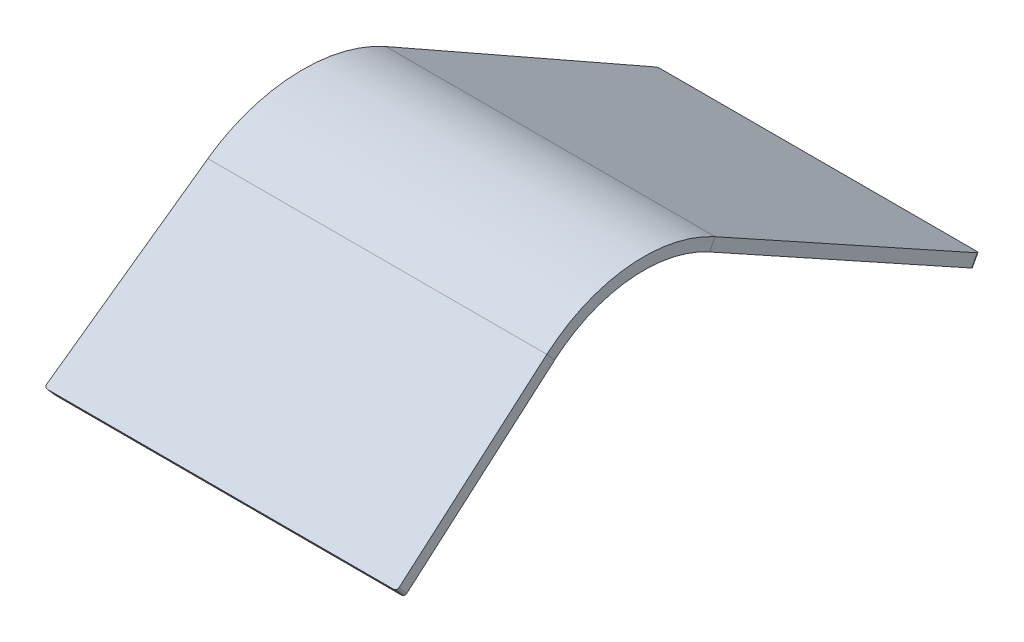
ISO-10303-21;
HEADER;
FILE_DESCRIPTION(('STEP AP214'),'2;1');
FILE_NAME('part.step','',(''),(''),'','','');
FILE_SCHEMA(('AUTOMOTIVE_DESIGN { 1 0 10303 214 1 1 1 1 }'));
ENDSEC;
DATA;
#1=APPLICATION_CONTEXT('core data for automotive mechanical design processes');
#2=APPLICATION_PROTOCOL_DEFINITION('international standard','automotive_design',2000,#1);
#3=PRODUCT_CONTEXT('',#1,'mechanical');
#4=PRODUCT('Part','Part','',(#3));
#5=PRODUCT_RELATED_PRODUCT_CATEGORY('part','',(#4));
#6=PRODUCT_DEFINITION_FORMATION('','',#4);
#7=PRODUCT_DEFINITION_CONTEXT('part definition',#1,'design');
#8=PRODUCT_DEFINITION('design','',#6,#7);
#9=PRODUCT_DEFINITION_SHAPE('','',#8);
#10=(LENGTH_UNIT() NAMED_UNIT(*) SI_UNIT(.MILLI.,.METRE.));
#11=(NAMED_UNIT(*) PLANE_ANGLE_UNIT() SI_UNIT($,.RADIAN.));
#12=(NAMED_UNIT(*) SI_UNIT($,.STERADIAN.) SOLID_ANGLE_UNIT());
#13=UNCERTAINTY_MEASURE_WITH_UNIT(LENGTH_MEASURE(1.E-05),#10,'distance_accuracy_value','');
#14=(GEOMETRIC_REPRESENTATION_CONTEXT(3) GLOBAL_UNCERTAINTY_ASSIGNED_CONTEXT((#13)) GLOBAL_UNIT_ASSIGNED_CONTEXT((#10,
#11,#12)) REPRESENTATION_CONTEXT('',''));
#15=CARTESIAN_POINT('',(0.,0.,0.));
#16=DIRECTION('',(0.,0.,1.));
#17=DIRECTION('',(1.,0.,0.));
#18=AXIS2_PLACEMENT_3D('',#15,#16,#17);
#19=CARTESIAN_POINT('',(148.,7.96839510967648,-2.12242299650277));
#20=DIRECTION('',(0.,0.87503404241775,-0.484061385167266));
#21=DIRECTION('',(0.,0.484061385167266,0.87503404241775));
#22=AXIS2_PLACEMENT_3D('',#19,#20,#21);
#23=CYLINDRICAL_SURFACE('',#22,2.);
#24=DIRECTION('',(0.,0.87503404241775,-0.484061385167266));
#25=VECTOR('',#24,1.);
#26=CARTESIAN_POINT('',(150.,7.96839510967642,-2.12242299650284));
#27=LINE('',#26,#25);
#28=CARTESIAN_POINT('',(150.,0.968122770334423,1.75006808483527));
#29=VERTEX_POINT('',#28);
#30=CARTESIAN_POINT('',(150.,7.96839510967642,-2.12242299650284));
#31=VERTEX_POINT('',#30);
#32=EDGE_CURVE('E11',#29,#31,#27,.T.);
#33=ORIENTED_EDGE('',*,*,#32,.F.);
#34=CARTESIAN_POINT('',(148.,0.968122770334473,1.75006808483535));
#35=DIRECTION('',(0.,-0.87503404241775,0.484061385167266));
#36=DIRECTION('',(0.,-0.484061385167266,-0.87503404241775));
#37=AXIS2_PLACEMENT_3D('',#34,#35,#36);
#38=CIRCLE('',#37,2.);
#39=CARTESIAN_POINT('',(148.,0.,-1.66533453693773E-13));
#40=VERTEX_POINT('',#39);
#41=EDGE_CURVE('E136',#40,#29,#38,.T.);
#42=ORIENTED_EDGE('',*,*,#41,.F.);
#43=DIRECTION('',(0.,0.87503404241775,-0.484061385167266));
#44=VECTOR('',#43,1.);
#45=CARTESIAN_POINT('',(148.,7.00027233934195,-3.87249108133825));
#46=LINE('',#45,#44);
#47=CARTESIAN_POINT('',(148.,7.00027233934195,-3.87249108133825));
#48=VERTEX_POINT('',#47);
#49=EDGE_CURVE('E47',#40,#48,#46,.T.);
#50=ORIENTED_EDGE('',*,*,#49,.T.);
#51=CARTESIAN_POINT('',(148.,7.96839510967648,-2.12242299650277));
#52=DIRECTION('',(0.,-0.87503404241775,0.484061385167266));
#53=DIRECTION('',(0.,0.484061385167266,0.87503404241775));
#54=AXIS2_PLACEMENT_3D('',#51,#52,#53);
#55=CIRCLE('',#54,2.);
#56=EDGE_CURVE('E199',#48,#31,#55,.T.);
#57=ORIENTED_EDGE('',*,*,#56,.T.);
#58=EDGE_LOOP('',(#33,#42,#50,#57));
#59=FACE_BOUND('',#58,.T.);
#60=ADVANCED_FACE('F37',(#59),#23,.T.);
#61=CARTESIAN_POINT('',(-150.,7.00027233934195,-3.87249108133825));
#62=DIRECTION('',(0.,0.484061385167266,0.87503404241775));
#63=DIRECTION('',(1.,0.,0.));
#64=AXIS2_PLACEMENT_3D('',#61,#62,#63);
#65=PLANE('',#64);
#66=ORIENTED_EDGE('',*,*,#49,.F.);
#67=DIRECTION('',(1.,0.,0.));
#68=VECTOR('',#67,1.);
#69=CARTESIAN_POINT('',(-150.,0.,-1.66533453693773E-13));
#70=LINE('',#69,#68);
#71=CARTESIAN_POINT('',(-65.7299312475215,0.,-1.66533453693773E-13));
#72=VERTEX_POINT('',#71);
#73=EDGE_CURVE('E146',#72,#40,#70,.T.);
#74=ORIENTED_EDGE('',*,*,#73,.F.);
#75=DIRECTION('',(0.,0.87503404241775,-0.484061385167266));
#76=VECTOR('',#75,1.);
#77=CARTESIAN_POINT('',(-65.7299312475215,7.00027233934195,-3.87249108133825));
#78=LINE('',#77,#76);
#79=CARTESIAN_POINT('',(-65.7299312475215,7.00027233934195,-3.87249108133825));
#80=VERTEX_POINT('',#79);
#81=EDGE_CURVE('E192',#72,#80,#78,.T.);
#82=ORIENTED_EDGE('',*,*,#81,.T.);
#83=DIRECTION('',(1.,0.,0.));
#84=VECTOR('',#83,1.);
#85=CARTESIAN_POINT('',(-150.,7.00027233934195,-3.87249108133825));
#86=LINE('',#85,#84);
#87=EDGE_CURVE('E209',#80,#48,#86,.T.);
#88=ORIENTED_EDGE('',*,*,#87,.T.);
#89=EDGE_LOOP('',(#66,#74,#82,#88));
#90=FACE_BOUND('',#89,.T.);
#91=ADVANCED_FACE('F212',(#90),#65,.F.);
#92=CARTESIAN_POINT('',(-65.7299312475215,7.96839510967646,-2.12242299650274));
#93=DIRECTION('',(0.,0.87503404241775,-0.484061385167266));
#94=DIRECTION('',(0.,0.484061385167266,0.87503404241775));
#95=AXIS2_PLACEMENT_3D('',#92,#93,#94);
#96=CYLINDRICAL_SURFACE('',#95,2.);
#97=ORIENTED_EDGE('',*,*,#81,.F.);
#98=CARTESIAN_POINT('',(-65.7299312475215,0.968122770334458,1.75006808483539));
#99=DIRECTION('',(0.,-0.87503404241775,0.484061385167266));
#100=DIRECTION('',(0.,-0.484061385167266,-0.87503404241775));
#101=AXIS2_PLACEMENT_3D('',#98,#99,#100);
#102=CIRCLE('',#101,2.);
#103=CARTESIAN_POINT('',(-67.7293180904833,0.94415194403627,1.70673620652706));
#104=VERTEX_POINT('',#103);
#105=EDGE_CURVE('E141',#104,#72,#102,.T.);
#106=ORIENTED_EDGE('',*,*,#105,.F.);
#107=DIRECTION('',(0.,0.87503404241775,-0.484061385167266));
#108=VECTOR('',#107,1.);
#109=CARTESIAN_POINT('',(-67.7293180904833,7.94442428337827,-2.16575487481105));
#110=LINE('',#109,#108);
#111=CARTESIAN_POINT('',(-67.7293180904833,7.94442428337827,-2.16575487481105));
#112=VERTEX_POINT('',#111);
#113=EDGE_CURVE('E190',#104,#112,#110,.T.);
#114=ORIENTED_EDGE('',*,*,#113,.T.);
#115=CARTESIAN_POINT('',(-65.7299312475215,7.96839510967646,-2.12242299650274));
#116=DIRECTION('',(0.,-0.87503404241775,0.484061385167266));
#117=DIRECTION('',(0.,0.484061385167266,0.87503404241775));
#118=AXIS2_PLACEMENT_3D('',#115,#116,#117);
#119=CIRCLE('',#118,2.);
#120=EDGE_CURVE('E213',#112,#80,#119,.T.);
#121=ORIENTED_EDGE('',*,*,#120,.T.);
#122=EDGE_LOOP('',(#97,#106,#114,#121));
#123=FACE_BOUND('',#122,.T.);
#124=ADVANCED_FACE('F299',(#123),#96,.T.);
#125=CARTESIAN_POINT('',(-74.3790367037548,137.906898779373,232.766410560256));
#126=DIRECTION('',(0.999693421480913,0.0119854131491104,0.0216659391541612));
#127=DIRECTION('',(0.024760110011603,-0.483912982344654,-0.874765775776874));
#128=AXIS2_PLACEMENT_3D('',#125,#126,#127);
#129=PLANE('',#128);
#130=ORIENTED_EDGE('',*,*,#113,.F.);
#131=DIRECTION('',(0.024760110011603,-0.483912982344654,-0.874765775776874));
#132=VECTOR('',#131,1.);
#133=CARTESIAN_POINT('',(-74.3790367037548,130.906626440031,236.638901641594));
#134=LINE('',#133,#132);
#135=CARTESIAN_POINT('',(-72.7411209673421,98.8951091864612,178.771928144757));
#136=VERTEX_POINT('',#135);
#137=EDGE_CURVE('E132',#136,#104,#134,.T.);
#138=ORIENTED_EDGE('',*,*,#137,.F.);
#139=DIRECTION('',(0.,0.87503404241775,-0.484061385167266));
#140=VECTOR('',#139,1.);
#141=CARTESIAN_POINT('',(-72.7411209673421,105.895381525803,174.899437063419));
#142=LINE('',#141,#140);
#143=CARTESIAN_POINT('',(-72.7411209673421,105.895381525803,174.899437063419));
#144=VERTEX_POINT('',#143);
#145=EDGE_CURVE('E187',#136,#144,#142,.T.);
#146=ORIENTED_EDGE('',*,*,#145,.T.);
#147=DIRECTION('',(0.024760110011603,-0.483912982344654,-0.874765775776874));
#148=VECTOR('',#147,1.);
#149=CARTESIAN_POINT('',(-74.3790367037548,137.906898779373,232.766410560256));
#150=LINE('',#149,#148);
#151=EDGE_CURVE('E240',#144,#112,#150,.T.);
#152=ORIENTED_EDGE('',*,*,#151,.T.);
#153=EDGE_LOOP('',(#130,#138,#146,#152));
#154=FACE_BOUND('',#153,.T.);
#155=ADVANCED_FACE('F239',(#154),#129,.F.);
#156=CARTESIAN_POINT('',(-72.275857740146,82.3638728291293,146.444684482223));
#157=CARTESIAN_POINT('',(-72.275857740146,80.6579556145933,148.494308244834));
#158=CARTESIAN_POINT('',(-72.275857740146,78.9520384000573,150.543932007445));
#159=CARTESIAN_POINT('',(-72.275857740146,77.2461211855212,152.593555770057));
#160=CARTESIAN_POINT('',(-72.275857740146,-71.3579093667152,18.5008933920208));
#161=CARTESIAN_POINT('',(-72.275857740146,-68.9645790560288,23.9623515837041));
#162=CARTESIAN_POINT('',(-72.275857740146,-66.5712487453423,29.4238097753875));
#163=CARTESIAN_POINT('',(-72.275857740146,-64.1779184346558,34.8852679670708));
#164=CARTESIAN_POINT('',(-85.9258965693787,-199.301700456918,172.222675587865));
#165=CARTESIAN_POINT('',(-85.9258965693787,-193.496535717159,173.584886254326));
#166=CARTESIAN_POINT('',(-85.9258965693787,-187.6913709774,174.947096920787));
#167=CARTESIAN_POINT('',(-85.9258965693787,-181.886206237642,176.309307587248));
#168=CARTESIAN_POINT('',(-85.9258965693787,-45.5799182610729,300.166466678068));
#169=CARTESIAN_POINT('',(-85.9258965693787,-43.8740010465368,298.116842915456));
#170=CARTESIAN_POINT('',(-85.9258965693787,-42.1680838320008,296.067219152845));
#171=CARTESIAN_POINT('',(-85.9258965693787,-40.4621666174648,294.017595390234));
#172=CARTESIAN_POINT('',(-85.9258965693787,108.141863934772,428.11025776827));
#173=CARTESIAN_POINT('',(-85.9258965693787,105.748533624085,422.648799576586));
#174=CARTESIAN_POINT('',(-85.9258965693787,103.355203313399,417.187341384903));
#175=CARTESIAN_POINT('',(-85.9258965693787,100.961873002712,411.72588319322));
#176=CARTESIAN_POINT('',(-72.275857740146,236.085655024974,274.388475572425));
#177=CARTESIAN_POINT('',(-72.275857740146,230.280490285215,273.026264905965));
#178=CARTESIAN_POINT('',(-72.275857740146,224.475325545457,271.664054239504));
#179=CARTESIAN_POINT('',(-72.275857740146,218.670160805698,270.301843573043));
#180=CARTESIAN_POINT('',(-72.275857740146,82.3638728291293,146.444684482223));
#181=CARTESIAN_POINT('',(-72.275857740146,80.6579556145933,148.494308244834));
#182=CARTESIAN_POINT('',(-72.275857740146,78.9520384000573,150.543932007445));
#183=CARTESIAN_POINT('',(-72.275857740146,77.2461211855212,152.593555770057));
#184=(BOUNDED_SURFACE() B_SPLINE_SURFACE(3,3,((#156,#157,#158,#159),(#160,#161,#162,#163),(#164,
#165,#166,#167),(#168,#169,#170,#171),(#172,#173,#174,#175),(#176,#177,#178,#179),(#180,#181,
#182,#183)),.UNSPECIFIED.,.T.,.F.,.F.) B_SPLINE_SURFACE_WITH_KNOTS((4,3,4),(4,4),(0.,0.5,1.),
(0.,1.),.UNSPECIFIED.) GEOMETRIC_REPRESENTATION_ITEM() RATIONAL_B_SPLINE_SURFACE(((1.,1.,1.,1.),
(0.333333333333333,0.333333333333333,0.333333333333333,0.333333333333333),(0.333333333333333,
0.333333333333333,0.333333333333333,0.333333333333333),(1.,1.,1.,1.),(0.333333333333333,
0.333333333333333,0.333333333333333,0.333333333333333),(0.333333333333333,0.333333333333333,
0.333333333333333,0.333333333333333),(1.,1.,1.,1.))) REPRESENTATION_ITEM('') SURFACE());
#185=CARTESIAN_POINT('',(-79.1008771547623,18.3919772840282,223.305575580145));
#186=DIRECTION('',(0.997259599354234,-0.0473274939482296,0.0568629915886714));
#187=DIRECTION('',(0.0739816970326649,0.637965869212384,-0.766502614623234));
#188=AXIS2_PLACEMENT_3D('',#185,#186,#187);
#189=ELLIPSE('',#188,92.2528096591637,92.);
#190=CARTESIAN_POINT('',(-79.1008771547623,89.1039970941174,282.159719481638));
#191=VERTEX_POINT('',#190);
#192=EDGE_CURVE('E128',#191,#136,#189,.F.);
#193=DIRECTION('',(0.,0.76860891097923,0.639718955451003));
#194=VECTOR('',#193,1.);
#195=CARTESIAN_POINT('',(-79.1008771547623,95.2528683819512,287.277471125246));
#196=LINE('',#195,#194);
#197=CARTESIAN_POINT('',(-79.1008771547623,95.2528683819512,287.277471125246));
#198=VERTEX_POINT('',#197);
#199=EDGE_CURVE('E55',#191,#198,#196,.T.);
#200=CARTESIAN_POINT('',(-79.1008771547623,18.3919772840282,223.305575580145));
#201=DIRECTION('',(0.997679060715675,-0.0435596085109254,0.0523359562429404));
#202=DIRECTION('',(0.0680917895894069,0.638234206596377,-0.766825016363449));
#203=AXIS2_PLACEMENT_3D('',#200,#201,#202);
#204=ELLIPSE('',#203,100.232633857491,100.);
#205=EDGE_CURVE('E220',#198,#144,#204,.F.);
#206=ORIENTED_EDGE('',*,*,#145,.F.);
#207=ORIENTED_EDGE('',*,*,#192,.F.);
#208=ORIENTED_EDGE('',*,*,#199,.T.);
#209=ORIENTED_EDGE('',*,*,#205,.T.);
#210=EDGE_LOOP('',(#206,#207,#208,#209));
#211=FACE_BOUND('',#210,.T.);
#212=ADVANCED_FACE('F234',(#211),#184,.T.);
#213=CARTESIAN_POINT('',(-72.8218592933153,82.3638728291293,146.444684482223));
#214=CARTESIAN_POINT('',(-72.8218592933153,80.6579556145933,148.494308244834));
#215=CARTESIAN_POINT('',(-72.8218592933153,78.9520384000573,150.543932007445));
#216=CARTESIAN_POINT('',(-72.8218592933153,77.2461211855212,152.593555770057));
#217=CARTESIAN_POINT('',(-72.8218592933153,-71.3579093667153,18.5008933920208));
#218=CARTESIAN_POINT('',(-72.8218592933153,-68.9645790560288,23.9623515837041));
#219=CARTESIAN_POINT('',(-72.8218592933153,-66.5712487453423,29.4238097753874));
#220=CARTESIAN_POINT('',(-72.8218592933153,-64.1779184346558,34.8852679670707));
#221=CARTESIAN_POINT('',(-85.3798950162094,-199.301700456918,172.222675587865));
#222=CARTESIAN_POINT('',(-85.3798950162094,-193.496535717159,173.584886254326));
#223=CARTESIAN_POINT('',(-85.3798950162094,-187.6913709774,174.947096920787));
#224=CARTESIAN_POINT('',(-85.3798950162094,-181.886206237642,176.309307587248));
#225=CARTESIAN_POINT('',(-85.3798950162094,-45.5799182610729,300.166466678068));
#226=CARTESIAN_POINT('',(-85.3798950162094,-43.8740010465368,298.116842915456));
#227=CARTESIAN_POINT('',(-85.3798950162094,-42.1680838320008,296.067219152845));
#228=CARTESIAN_POINT('',(-85.3798950162094,-40.4621666174648,294.017595390234));
#229=CARTESIAN_POINT('',(-85.3798950162094,108.141863934772,428.11025776827));
#230=CARTESIAN_POINT('',(-85.3798950162094,105.748533624085,422.648799576587));
#231=CARTESIAN_POINT('',(-85.3798950162094,103.355203313399,417.187341384903));
#232=CARTESIAN_POINT('',(-85.3798950162094,100.961873002712,411.72588319322));
#233=CARTESIAN_POINT('',(-72.8218592933153,236.085655024974,274.388475572425));
#234=CARTESIAN_POINT('',(-72.8218592933153,230.280490285216,273.026264905965));
#235=CARTESIAN_POINT('',(-72.8218592933153,224.475325545457,271.664054239504));
#236=CARTESIAN_POINT('',(-72.8218592933153,218.670160805698,270.301843573043));
#237=CARTESIAN_POINT('',(-72.8218592933153,82.3638728291293,146.444684482223));
#238=CARTESIAN_POINT('',(-72.8218592933153,80.6579556145933,148.494308244834));
#239=CARTESIAN_POINT('',(-72.8218592933153,78.9520384000573,150.543932007445));
#240=CARTESIAN_POINT('',(-72.8218592933153,77.2461211855212,152.593555770057));
#241=(BOUNDED_SURFACE() B_SPLINE_SURFACE(3,3,((#213,#214,#215,#216),(#217,#218,#219,#220),(#221,
#222,#223,#224),(#225,#226,#227,#228),(#229,#230,#231,#232),(#233,#234,#235,#236),(#237,#238,
#239,#240)),.UNSPECIFIED.,.T.,.F.,.F.) B_SPLINE_SURFACE_WITH_KNOTS((4,3,4),(4,4),(0.,0.5,1.),
(0.,1.),.UNSPECIFIED.) GEOMETRIC_REPRESENTATION_ITEM() RATIONAL_B_SPLINE_SURFACE(((1.,1.,1.,1.),
(0.333333333333333,0.333333333333333,0.333333333333333,0.333333333333333),(0.333333333333333,
0.333333333333333,0.333333333333333,0.333333333333333),(1.,1.,1.,1.),(0.333333333333333,
0.333333333333333,0.333333333333333,0.333333333333333),(0.333333333333333,0.333333333333333,
0.333333333333333,0.333333333333333),(1.,1.,1.,1.))) REPRESENTATION_ITEM('') SURFACE());
#242=CARTESIAN_POINT('',(-79.1008771547623,18.3919772840282,223.305575580145));
#243=DIRECTION('',(0.997679060715675,-0.0435596085109254,0.0523359562429405));
#244=DIRECTION('',(0.068091789589407,0.638234206596377,-0.766825016363449));
#245=AXIS2_PLACEMENT_3D('',#242,#243,#244);
#246=ELLIPSE('',#245,92.2140231488919,92.);
#247=CARTESIAN_POINT('',(-79.2261863664963,87.9153729006915,283.559185114587));
#248=VERTEX_POINT('',#247);
#249=EDGE_CURVE('E143',#248,#191,#246,.F.);
#250=DIRECTION('',(0.,0.755689082789817,0.654930538417842));
#251=VECTOR('',#250,1.);
#252=CARTESIAN_POINT('',(-79.2261863664963,93.96088556301,288.79862942193));
#253=LINE('',#252,#251);
#254=CARTESIAN_POINT('',(-79.2261863664963,93.96088556301,288.79862942193));
#255=VERTEX_POINT('',#254);
#256=EDGE_CURVE('E183',#248,#255,#253,.T.);
#257=CARTESIAN_POINT('',(-79.1008771547623,18.3919772840282,223.305575580145));
#258=DIRECTION('',(0.99803450670407,-0.0400891174084973,0.0481662339546275));
#259=DIRECTION('',(0.0626667649393535,0.638461592132793,-0.767098215317501));
#260=AXIS2_PLACEMENT_3D('',#257,#258,#259);
#261=ELLIPSE('',#260,100.19693640678,100.);
#262=EDGE_CURVE('E117',#255,#198,#261,.F.);
#263=ORIENTED_EDGE('',*,*,#199,.F.);
#264=ORIENTED_EDGE('',*,*,#249,.F.);
#265=ORIENTED_EDGE('',*,*,#256,.T.);
#266=ORIENTED_EDGE('',*,*,#262,.T.);
#267=EDGE_LOOP('',(#263,#264,#265,#266));
#268=FACE_BOUND('',#267,.T.);
#269=ADVANCED_FACE('F230',(#268),#241,.T.);
#270=CARTESIAN_POINT('',(-88.6715665537237,3.3047306055099,393.401885142122));
#271=DIRECTION('',(0.997679981872384,-0.0445865520949319,0.0514460216479983));
#272=DIRECTION('',(0.0680782914820898,0.653411087696383,-0.753935870418903));
#273=AXIS2_PLACEMENT_3D('',#270,#271,#272);
#274=PLANE('',#273);
#275=ORIENTED_EDGE('',*,*,#256,.F.);
#276=DIRECTION('',(0.0680782914820898,0.653411087696383,-0.753935870418903));
#277=VECTOR('',#276,1.);
#278=CARTESIAN_POINT('',(-88.6715665537237,-2.74078205680865,388.162440834779));
#279=LINE('',#278,#277);
#280=CARTESIAN_POINT('',(-88.2402429630648,1.3990341810255,383.385729791124));
#281=VERTEX_POINT('',#280);
#282=EDGE_CURVE('E162',#281,#248,#279,.T.);
#283=ORIENTED_EDGE('',*,*,#282,.F.);
#284=DIRECTION('',(0.,0.755689082789817,0.654930538417842));
#285=VECTOR('',#284,1.);
#286=CARTESIAN_POINT('',(-88.2402429630648,7.44454684334405,388.625174098467));
#287=LINE('',#286,#285);
#288=CARTESIAN_POINT('',(-88.2402429630648,7.44454684334405,388.625174098467));
#289=VERTEX_POINT('',#288);
#290=EDGE_CURVE('E180',#281,#289,#287,.T.);
#291=ORIENTED_EDGE('',*,*,#290,.T.);
#292=DIRECTION('',(0.0680782914820898,0.653411087696383,-0.753935870418903));
#293=VECTOR('',#292,1.);
#294=CARTESIAN_POINT('',(-88.6715665537237,3.3047306055099,393.401885142122));
#295=LINE('',#294,#293);
#296=EDGE_CURVE('E256',#289,#255,#295,.T.);
#297=ORIENTED_EDGE('',*,*,#296,.T.);
#298=EDGE_LOOP('',(#275,#283,#291,#297));
#299=FACE_BOUND('',#298,.T.);
#300=ADVANCED_FACE('F320',(#299),#274,.F.);
#301=CARTESIAN_POINT('',(-86.24488299932,7.35537373915417,388.728066141763));
#302=DIRECTION('',(0.,0.755689082789817,0.654930538417842));
#303=DIRECTION('',(0.,-0.654930538417842,0.755689082789817));
#304=AXIS2_PLACEMENT_3D('',#301,#302,#303);
#305=CYLINDRICAL_SURFACE('',#304,2.);
#306=ORIENTED_EDGE('',*,*,#290,.F.);
#307=CARTESIAN_POINT('',(-86.24488299932,1.30986107683562,383.48862183442));
#308=DIRECTION('',(0.,-0.755689082789817,-0.654930538417842));
#309=DIRECTION('',(0.,0.654930538417842,-0.755689082789817));
#310=AXIS2_PLACEMENT_3D('',#307,#308,#309);
#311=CIRCLE('',#310,2.);
#312=CARTESIAN_POINT('',(-86.24488299932,0.,385.));
#313=VERTEX_POINT('',#312);
#314=EDGE_CURVE('E159',#313,#281,#311,.T.);
#315=ORIENTED_EDGE('',*,*,#314,.F.);
#316=DIRECTION('',(0.,0.755689082789817,0.654930538417842));
#317=VECTOR('',#316,1.);
#318=CARTESIAN_POINT('',(-86.24488299932,6.04551266231849,390.239444307343));
#319=LINE('',#318,#317);
#320=CARTESIAN_POINT('',(-86.24488299932,6.04551266231849,390.239444307343));
#321=VERTEX_POINT('',#320);
#322=EDGE_CURVE('E177',#313,#321,#319,.T.);
#323=ORIENTED_EDGE('',*,*,#322,.T.);
#324=CARTESIAN_POINT('',(-86.24488299932,7.35537373915417,388.728066141763));
#325=DIRECTION('',(0.,-0.755689082789817,-0.654930538417842));
#326=DIRECTION('',(0.,-0.654930538417842,0.755689082789817));
#327=AXIS2_PLACEMENT_3D('',#324,#325,#326);
#328=CIRCLE('',#327,2.);
#329=EDGE_CURVE('E253',#321,#289,#328,.T.);
#330=ORIENTED_EDGE('',*,*,#329,.T.);
#331=EDGE_LOOP('',(#306,#315,#323,#330));
#332=FACE_BOUND('',#331,.T.);
#333=ADVANCED_FACE('F328',(#332),#305,.T.);
#334=CARTESIAN_POINT('',(-150.,6.04551266231849,390.239444307343));
#335=DIRECTION('',(0.,-0.654930538417842,0.755689082789817));
#336=DIRECTION('',(1.,0.,0.));
#337=AXIS2_PLACEMENT_3D('',#334,#335,#336);
#338=PLANE('',#337);
#339=ORIENTED_EDGE('',*,*,#322,.F.);
#340=DIRECTION('',(1.,0.,0.));
#341=VECTOR('',#340,1.);
#342=CARTESIAN_POINT('',(-150.,0.,385.));
#343=LINE('',#342,#341);
#344=CARTESIAN_POINT('',(148.,0.,385.));
#345=VERTEX_POINT('',#344);
#346=EDGE_CURVE('E156',#313,#345,#343,.T.);
#347=ORIENTED_EDGE('',*,*,#346,.T.);
#348=DIRECTION('',(0.,0.755689082789817,0.654930538417842));
#349=VECTOR('',#348,1.);
#350=CARTESIAN_POINT('',(148.,6.04551266231849,390.239444307343));
#351=LINE('',#350,#349);
#352=CARTESIAN_POINT('',(148.,6.04551266231849,390.239444307343));
#353=VERTEX_POINT('',#352);
#354=EDGE_CURVE('E174',#345,#353,#351,.T.);
#355=ORIENTED_EDGE('',*,*,#354,.T.);
#356=DIRECTION('',(1.,0.,0.));
#357=VECTOR('',#356,1.);
#358=CARTESIAN_POINT('',(-150.,6.04551266231849,390.239444307343));
#359=LINE('',#358,#357);
#360=EDGE_CURVE('E248',#321,#353,#359,.T.);
#361=ORIENTED_EDGE('',*,*,#360,.F.);
#362=EDGE_LOOP('',(#339,#347,#355,#361));
#363=FACE_BOUND('',#362,.T.);
#364=ADVANCED_FACE('F292',(#363),#338,.T.);
#365=CARTESIAN_POINT('',(148.,7.35537373915417,388.728066141763));
#366=DIRECTION('',(0.,0.755689082789817,0.654930538417842));
#367=DIRECTION('',(0.,-0.654930538417842,0.755689082789817));
#368=AXIS2_PLACEMENT_3D('',#365,#366,#367);
#369=CYLINDRICAL_SURFACE('',#368,2.);
#370=ORIENTED_EDGE('',*,*,#354,.F.);
#371=CARTESIAN_POINT('',(148.,1.30986107683562,383.48862183442));
#372=DIRECTION('',(0.,-0.755689082789817,-0.654930538417842));
#373=DIRECTION('',(0.,0.654930538417842,-0.755689082789817));
#374=AXIS2_PLACEMENT_3D('',#371,#372,#373);
#375=CIRCLE('',#374,2.);
#376=CARTESIAN_POINT('',(150.,1.30986107683562,383.48862183442));
#377=VERTEX_POINT('',#376);
#378=EDGE_CURVE('E153',#377,#345,#375,.T.);
#379=ORIENTED_EDGE('',*,*,#378,.F.);
#380=DIRECTION('',(0.,0.755689082789817,0.654930538417842));
#381=VECTOR('',#380,1.);
#382=CARTESIAN_POINT('',(150.,7.35537373915416,388.728066141763));
#383=LINE('',#382,#381);
#384=CARTESIAN_POINT('',(150.,7.35537373915416,388.728066141763));
#385=VERTEX_POINT('',#384);
#386=EDGE_CURVE('E171',#377,#385,#383,.T.);
#387=ORIENTED_EDGE('',*,*,#386,.T.);
#388=CARTESIAN_POINT('',(148.,7.35537373915417,388.728066141763));
#389=DIRECTION('',(0.,-0.755689082789817,-0.654930538417842));
#390=DIRECTION('',(0.,-0.654930538417842,0.755689082789817));
#391=AXIS2_PLACEMENT_3D('',#388,#389,#390);
#392=CIRCLE('',#391,2.);
#393=EDGE_CURVE('E244',#385,#353,#392,.T.);
#394=ORIENTED_EDGE('',*,*,#393,.T.);
#395=EDGE_LOOP('',(#370,#379,#387,#394));
#396=FACE_BOUND('',#395,.T.);
#397=ADVANCED_FACE('F283',(#396),#369,.T.);
#398=CARTESIAN_POINT('',(150.,6.04551266231849,390.239444307343));
#399=DIRECTION('',(1.,0.,0.));
#400=DIRECTION('',(0.,0.654930538417842,-0.755689082789818));
#401=AXIS2_PLACEMENT_3D('',#398,#399,#400);
#402=PLANE('',#401);
#403=ORIENTED_EDGE('',*,*,#386,.F.);
#404=DIRECTION('',(0.,-0.654930538417842,0.755689082789817));
#405=VECTOR('',#404,1.);
#406=CARTESIAN_POINT('',(150.,0.,385.));
#407=LINE('',#406,#405);
#408=CARTESIAN_POINT('',(150.,87.9153729006915,283.559185114587));
#409=VERTEX_POINT('',#408);
#410=EDGE_CURVE('E150',#377,#409,#407,.F.);
#411=ORIENTED_EDGE('',*,*,#410,.T.);
#412=DIRECTION('',(0.,0.755689082789818,0.654930538417842));
#413=VECTOR('',#412,1.);
#414=CARTESIAN_POINT('',(150.,93.96088556301,288.798629421929));
#415=LINE('',#414,#413);
#416=CARTESIAN_POINT('',(150.,93.96088556301,288.798629421929));
#417=VERTEX_POINT('',#416);
#418=EDGE_CURVE('E116',#409,#417,#415,.T.);
#419=ORIENTED_EDGE('',*,*,#418,.T.);
#420=DIRECTION('',(0.,0.654930538417842,-0.755689082789818));
#421=VECTOR('',#420,1.);
#422=CARTESIAN_POINT('',(150.,6.04551266231849,390.239444307343));
#423=LINE('',#422,#421);
#424=EDGE_CURVE('E165',#385,#417,#423,.T.);
#425=ORIENTED_EDGE('',*,*,#424,.F.);
#426=EDGE_LOOP('',(#403,#411,#419,#425));
#427=FACE_BOUND('',#426,.T.);
#428=ADVANCED_FACE('F284',(#427),#402,.T.);
#429=CARTESIAN_POINT('',(150.,18.3919772840282,223.305575580145));
#430=DIRECTION('',(-1.,0.,0.));
#431=DIRECTION('',(0.,0.,1.));
#432=AXIS2_PLACEMENT_3D('',#429,#430,#431);
#433=PLANE('',#432);
#434=ORIENTED_EDGE('',*,*,#418,.F.);
#435=CARTESIAN_POINT('',(150.,18.3919772840282,223.305575580145));
#436=DIRECTION('',(1.,0.,0.));
#437=DIRECTION('',(0.,0.,-1.));
#438=AXIS2_PLACEMENT_3D('',#435,#436,#437);
#439=CIRCLE('',#438,92.);
#440=CARTESIAN_POINT('',(150.,98.8951091864612,178.771928144757));
#441=VERTEX_POINT('',#440);
#442=EDGE_CURVE('E125',#409,#441,#439,.F.);
#443=ORIENTED_EDGE('',*,*,#442,.T.);
#444=DIRECTION('',(0.,0.87503404241775,-0.484061385167266));
#445=VECTOR('',#444,1.);
#446=CARTESIAN_POINT('',(150.,105.895381525803,174.899437063419));
#447=LINE('',#446,#445);
#448=CARTESIAN_POINT('',(150.,105.895381525803,174.899437063419));
#449=VERTEX_POINT('',#448);
#450=EDGE_CURVE('E41',#441,#449,#447,.T.);
#451=ORIENTED_EDGE('',*,*,#450,.T.);
#452=CARTESIAN_POINT('',(150.,18.3919772840282,223.305575580145));
#453=DIRECTION('',(1.,0.,0.));
#454=DIRECTION('',(0.,0.,-1.));
#455=AXIS2_PLACEMENT_3D('',#452,#453,#454);
#456=CIRCLE('',#455,100.);
#457=EDGE_CURVE('E215',#417,#449,#456,.F.);
#458=ORIENTED_EDGE('',*,*,#457,.F.);
#459=EDGE_LOOP('',(#434,#443,#451,#458));
#460=FACE_BOUND('',#459,.T.);
#461=ADVANCED_FACE('F138',(#460),#433,.F.);
#462=CARTESIAN_POINT('',(150.,137.000272339342,231.127508918662));
#463=DIRECTION('',(1.,0.,0.));
#464=DIRECTION('',(0.,-0.484061385167266,-0.87503404241775));
#465=AXIS2_PLACEMENT_3D('',#462,#463,#464);
#466=PLANE('',#465);
#467=DIRECTION('',(0.,0.484061385167266,0.87503404241775));
#468=VECTOR('',#467,1.);
#469=CARTESIAN_POINT('',(150.,130.,235.));
#470=LINE('',#469,#468);
#471=EDGE_CURVE('E107',#441,#29,#470,.F.);
#472=ORIENTED_EDGE('',*,*,#471,.T.);
#473=ORIENTED_EDGE('',*,*,#32,.T.);
#474=DIRECTION('',(0.,-0.484061385167266,-0.87503404241775));
#475=VECTOR('',#474,1.);
#476=CARTESIAN_POINT('',(150.,137.000272339342,231.127508918662));
#477=LINE('',#476,#475);
#478=EDGE_CURVE('E110',#449,#31,#477,.T.);
#479=ORIENTED_EDGE('',*,*,#478,.F.);
#480=ORIENTED_EDGE('',*,*,#450,.F.);
#481=EDGE_LOOP('',(#472,#473,#479,#480));
#482=FACE_BOUND('',#481,.T.);
#483=ADVANCED_FACE('F39',(#482),#466,.T.);
#484=CARTESIAN_POINT('',(-150.,18.3919772840282,223.305575580145));
#485=DIRECTION('',(1.,0.,0.));
#486=DIRECTION('',(0.,0.,1.));
#487=AXIS2_PLACEMENT_3D('',#484,#485,#486);
#488=CYLINDRICAL_SURFACE('',#487,100.);
#489=DIRECTION('',(1.,0.,0.));
#490=VECTOR('',#489,1.);
#491=CARTESIAN_POINT('',(-150.,93.96088556301,288.798629421929));
#492=LINE('',#491,#490);
#493=EDGE_CURVE('E258',#255,#417,#492,.T.);
#494=ORIENTED_EDGE('',*,*,#493,.T.);
#495=ORIENTED_EDGE('',*,*,#457,.T.);
#496=DIRECTION('',(1.,0.,0.));
#497=VECTOR('',#496,1.);
#498=CARTESIAN_POINT('',(-150.,105.895381525803,174.899437063419));
#499=LINE('',#498,#497);
#500=EDGE_CURVE('E243',#144,#449,#499,.T.);
#501=ORIENTED_EDGE('',*,*,#500,.F.);
#502=ORIENTED_EDGE('',*,*,#205,.F.);
#503=ORIENTED_EDGE('',*,*,#262,.F.);
#504=EDGE_LOOP('',(#494,#495,#501,#502,#503));
#505=FACE_BOUND('',#504,.T.);
#506=ADVANCED_FACE('F271',(#505),#488,.T.);
#507=CARTESIAN_POINT('',(-150.,137.000272339342,231.127508918662));
#508=DIRECTION('',(0.,0.87503404241775,-0.484061385167266));
#509=DIRECTION('',(0.,0.484061385167266,0.87503404241775));
#510=AXIS2_PLACEMENT_3D('',#507,#508,#509);
#511=PLANE('',#510);
#512=ORIENTED_EDGE('',*,*,#151,.F.);
#513=ORIENTED_EDGE('',*,*,#500,.T.);
#514=ORIENTED_EDGE('',*,*,#478,.T.);
#515=ORIENTED_EDGE('',*,*,#56,.F.);
#516=ORIENTED_EDGE('',*,*,#87,.F.);
#517=ORIENTED_EDGE('',*,*,#120,.F.);
#518=EDGE_LOOP('',(#512,#513,#514,#515,#516,#517));
#519=FACE_BOUND('',#518,.T.);
#520=ADVANCED_FACE('F207',(#519),#511,.T.);
#521=CARTESIAN_POINT('',(-150.,6.04551266231849,390.239444307343));
#522=DIRECTION('',(0.,0.755689082789817,0.654930538417842));
#523=DIRECTION('',(0.,-0.654930538417842,0.755689082789817));
#524=AXIS2_PLACEMENT_3D('',#521,#522,#523);
#525=PLANE('',#524);
#526=ORIENTED_EDGE('',*,*,#424,.T.);
#527=ORIENTED_EDGE('',*,*,#493,.F.);
#528=ORIENTED_EDGE('',*,*,#296,.F.);
#529=ORIENTED_EDGE('',*,*,#329,.F.);
#530=ORIENTED_EDGE('',*,*,#360,.T.);
#531=ORIENTED_EDGE('',*,*,#393,.F.);
#532=EDGE_LOOP('',(#526,#527,#528,#529,#530,#531));
#533=FACE_BOUND('',#532,.T.);
#534=ADVANCED_FACE('F266',(#533),#525,.T.);
#535=CARTESIAN_POINT('',(-150.,18.3919772840282,223.305575580145));
#536=DIRECTION('',(1.,0.,0.));
#537=DIRECTION('',(0.,0.,1.));
#538=AXIS2_PLACEMENT_3D('',#535,#536,#537);
#539=CYLINDRICAL_SURFACE('',#538,92.);
#540=DIRECTION('',(1.,0.,0.));
#541=VECTOR('',#540,1.);
#542=CARTESIAN_POINT('',(-150.,87.9153729006915,283.559185114587));
#543=LINE('',#542,#541);
#544=EDGE_CURVE('E152',#248,#409,#543,.T.);
#545=ORIENTED_EDGE('',*,*,#544,.F.);
#546=ORIENTED_EDGE('',*,*,#249,.T.);
#547=ORIENTED_EDGE('',*,*,#192,.T.);
#548=DIRECTION('',(1.,0.,0.));
#549=VECTOR('',#548,1.);
#550=CARTESIAN_POINT('',(-150.,98.8951091864612,178.771928144757));
#551=LINE('',#550,#549);
#552=EDGE_CURVE('E122',#136,#441,#551,.T.);
#553=ORIENTED_EDGE('',*,*,#552,.T.);
#554=ORIENTED_EDGE('',*,*,#442,.F.);
#555=EDGE_LOOP('',(#545,#546,#547,#553,#554));
#556=FACE_BOUND('',#555,.T.);
#557=ADVANCED_FACE('F124',(#556),#539,.F.);
#558=CARTESIAN_POINT('',(-150.,130.,235.));
#559=DIRECTION('',(0.,0.87503404241775,-0.484061385167266));
#560=DIRECTION('',(0.,0.484061385167266,0.87503404241775));
#561=AXIS2_PLACEMENT_3D('',#558,#559,#560);
#562=PLANE('',#561);
#563=ORIENTED_EDGE('',*,*,#137,.T.);
#564=ORIENTED_EDGE('',*,*,#105,.T.);
#565=ORIENTED_EDGE('',*,*,#73,.T.);
#566=ORIENTED_EDGE('',*,*,#41,.T.);
#567=ORIENTED_EDGE('',*,*,#471,.F.);
#568=ORIENTED_EDGE('',*,*,#552,.F.);
#569=EDGE_LOOP('',(#563,#564,#565,#566,#567,#568));
#570=FACE_BOUND('',#569,.T.);
#571=ADVANCED_FACE('F134',(#570),#562,.F.);
#572=CARTESIAN_POINT('',(-150.,0.,385.));
#573=DIRECTION('',(0.,0.755689082789817,0.654930538417842));
#574=DIRECTION('',(0.,-0.654930538417842,0.755689082789817));
#575=AXIS2_PLACEMENT_3D('',#572,#573,#574);
#576=PLANE('',#575);
#577=ORIENTED_EDGE('',*,*,#410,.F.);
#578=ORIENTED_EDGE('',*,*,#378,.T.);
#579=ORIENTED_EDGE('',*,*,#346,.F.);
#580=ORIENTED_EDGE('',*,*,#314,.T.);
#581=ORIENTED_EDGE('',*,*,#282,.T.);
#582=ORIENTED_EDGE('',*,*,#544,.T.);
#583=EDGE_LOOP('',(#577,#578,#579,#580,#581,#582));
#584=FACE_BOUND('',#583,.T.);
#585=ADVANCED_FACE('F225',(#584),#576,.F.);
#586=CLOSED_SHELL('',(#60,#91,#124,#155,#212,#269,#300,#333,#364,#397,#428,#461,#483,#506,#520,
#534,#557,#571,#585));
#587=MANIFOLD_SOLID_BREP('B2',#586);
#588=ADVANCED_BREP_SHAPE_REPRESENTATION('',(#18,#587),#14);
#589=SHAPE_DEFINITION_REPRESENTATION(#9,#588);
ENDSEC;
END-ISO-10303-21;
